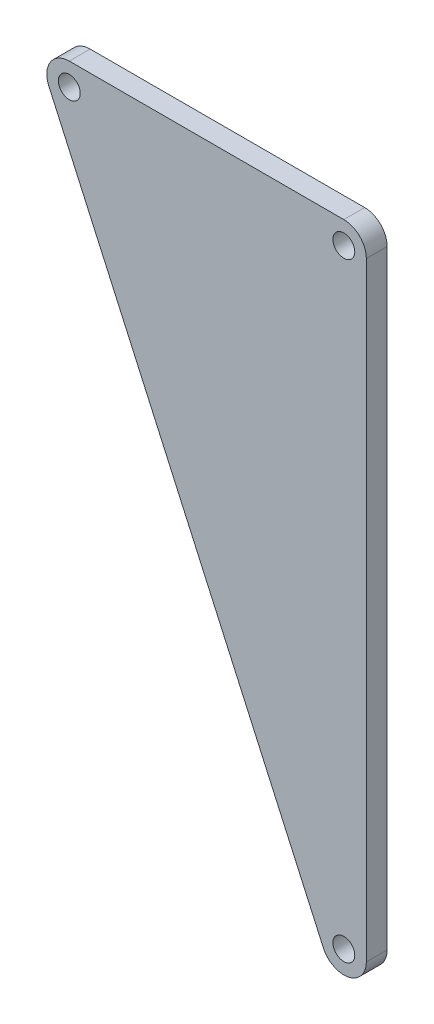
ISO-10303-21;
HEADER;
FILE_DESCRIPTION(('STEP AP214'),'2;1');
FILE_NAME('part.step','',(''),(''),'','','');
FILE_SCHEMA(('AUTOMOTIVE_DESIGN { 1 0 10303 214 1 1 1 1 }'));
ENDSEC;
DATA;
#1=APPLICATION_CONTEXT('core data for automotive mechanical design processes');
#2=APPLICATION_PROTOCOL_DEFINITION('international standard','automotive_design',2000,#1);
#3=PRODUCT_CONTEXT('',#1,'mechanical');
#4=PRODUCT('Part','Part','',(#3));
#5=PRODUCT_RELATED_PRODUCT_CATEGORY('part','',(#4));
#6=PRODUCT_DEFINITION_FORMATION('','',#4);
#7=PRODUCT_DEFINITION_CONTEXT('part definition',#1,'design');
#8=PRODUCT_DEFINITION('design','',#6,#7);
#9=PRODUCT_DEFINITION_SHAPE('','',#8);
#10=(LENGTH_UNIT() NAMED_UNIT(*) SI_UNIT(.MILLI.,.METRE.));
#11=(NAMED_UNIT(*) PLANE_ANGLE_UNIT() SI_UNIT($,.RADIAN.));
#12=(NAMED_UNIT(*) SI_UNIT($,.STERADIAN.) SOLID_ANGLE_UNIT());
#13=UNCERTAINTY_MEASURE_WITH_UNIT(LENGTH_MEASURE(1.E-05),#10,'distance_accuracy_value','');
#14=(GEOMETRIC_REPRESENTATION_CONTEXT(3) GLOBAL_UNCERTAINTY_ASSIGNED_CONTEXT((#13)) GLOBAL_UNIT_ASSIGNED_CONTEXT((#10,
#11,#12)) REPRESENTATION_CONTEXT('',''));
#15=CARTESIAN_POINT('',(0.,0.,0.));
#16=DIRECTION('',(0.,0.,1.));
#17=DIRECTION('',(1.,0.,0.));
#18=AXIS2_PLACEMENT_3D('',#15,#16,#17);
#19=CARTESIAN_POINT('',(0.,4.32,4.));
#20=DIRECTION('',(0.,1.,0.));
#21=DIRECTION('',(-1.,0.,0.));
#22=AXIS2_PLACEMENT_3D('',#19,#20,#21);
#23=PLANE('',#22);
#24=DIRECTION('',(1.,0.,0.));
#25=VECTOR('',#24,1.);
#26=CARTESIAN_POINT('',(0.,4.32,0.));
#27=LINE('',#26,#25);
#28=CARTESIAN_POINT('',(0.,4.32,0.));
#29=VERTEX_POINT('',#28);
#30=CARTESIAN_POINT('',(52.7,4.32,0.));
#31=VERTEX_POINT('',#30);
#32=EDGE_CURVE('E133',#29,#31,#27,.T.);
#33=ORIENTED_EDGE('',*,*,#32,.F.);
#34=DIRECTION('',(0.,0.,-1.));
#35=VECTOR('',#34,1.);
#36=CARTESIAN_POINT('',(0.,4.32,4.));
#37=LINE('',#36,#35);
#38=CARTESIAN_POINT('',(0.,4.32,4.));
#39=VERTEX_POINT('',#38);
#40=EDGE_CURVE('E11',#39,#29,#37,.T.);
#41=ORIENTED_EDGE('',*,*,#40,.F.);
#42=DIRECTION('',(1.,0.,0.));
#43=VECTOR('',#42,1.);
#44=CARTESIAN_POINT('',(0.,4.32,4.));
#45=LINE('',#44,#43);
#46=CARTESIAN_POINT('',(52.7,4.32,4.));
#47=VERTEX_POINT('',#46);
#48=EDGE_CURVE('E154',#39,#47,#45,.T.);
#49=ORIENTED_EDGE('',*,*,#48,.T.);
#50=DIRECTION('',(0.,0.,-1.));
#51=VECTOR('',#50,1.);
#52=CARTESIAN_POINT('',(52.7,4.32,4.));
#53=LINE('',#52,#51);
#54=EDGE_CURVE('E85',#47,#31,#53,.T.);
#55=ORIENTED_EDGE('',*,*,#54,.T.);
#56=EDGE_LOOP('',(#33,#41,#49,#55));
#57=FACE_BOUND('',#56,.T.);
#58=ADVANCED_FACE('F41',(#57),#23,.T.);
#59=CARTESIAN_POINT('',(0.,0.,4.));
#60=DIRECTION('',(0.,0.,-1.));
#61=DIRECTION('',(-1.,0.,0.));
#62=AXIS2_PLACEMENT_3D('',#59,#60,#61);
#63=CYLINDRICAL_SURFACE('',#62,4.32);
#64=CARTESIAN_POINT('',(0.,0.,0.));
#65=DIRECTION('',(0.,0.,1.));
#66=DIRECTION('',(1.,0.,0.));
#67=AXIS2_PLACEMENT_3D('',#64,#65,#66);
#68=CIRCLE('',#67,4.32);
#69=CARTESIAN_POINT('',(-3.93847296537443,-1.77505794300207,0.));
#70=VERTEX_POINT('',#69);
#71=EDGE_CURVE('E136',#29,#70,#68,.T.);
#72=ORIENTED_EDGE('',*,*,#71,.T.);
#73=DIRECTION('',(0.,0.,-1.));
#74=VECTOR('',#73,1.);
#75=CARTESIAN_POINT('',(-3.93847296537443,-1.77505794300207,4.));
#76=LINE('',#75,#74);
#77=CARTESIAN_POINT('',(-3.93847296537443,-1.77505794300207,4.));
#78=VERTEX_POINT('',#77);
#79=EDGE_CURVE('E49',#78,#70,#76,.T.);
#80=ORIENTED_EDGE('',*,*,#79,.F.);
#81=CARTESIAN_POINT('',(0.,0.,4.));
#82=DIRECTION('',(0.,0.,1.));
#83=DIRECTION('',(1.,0.,0.));
#84=AXIS2_PLACEMENT_3D('',#81,#82,#83);
#85=CIRCLE('',#84,4.32);
#86=EDGE_CURVE('E168',#39,#78,#85,.T.);
#87=ORIENTED_EDGE('',*,*,#86,.F.);
#88=ORIENTED_EDGE('',*,*,#40,.T.);
#89=EDGE_LOOP('',(#72,#80,#87,#88));
#90=FACE_BOUND('',#89,.T.);
#91=ADVANCED_FACE('F171',(#90),#63,.T.);
#92=CARTESIAN_POINT('',(-3.93847296537443,-1.77505794300207,4.));
#93=DIRECTION('',(0.911683556799636,0.410893042361591,0.));
#94=DIRECTION('',(-0.410893042361591,0.911683556799636,0.));
#95=AXIS2_PLACEMENT_3D('',#92,#93,#94);
#96=PLANE('',#95);
#97=DIRECTION('',(0.410893042361591,-0.911683556799636,0.));
#98=VECTOR('',#97,1.);
#99=CARTESIAN_POINT('',(-3.93847296537443,-1.77505794300207,0.));
#100=LINE('',#99,#98);
#101=CARTESIAN_POINT('',(48.7615270346256,-118.705057943002,0.));
#102=VERTEX_POINT('',#101);
#103=EDGE_CURVE('E138',#70,#102,#100,.T.);
#104=ORIENTED_EDGE('',*,*,#103,.T.);
#105=DIRECTION('',(0.,0.,-1.));
#106=VECTOR('',#105,1.);
#107=CARTESIAN_POINT('',(48.7615270346256,-118.705057943002,4.));
#108=LINE('',#107,#106);
#109=CARTESIAN_POINT('',(48.7615270346256,-118.705057943002,4.));
#110=VERTEX_POINT('',#109);
#111=EDGE_CURVE('E117',#110,#102,#108,.T.);
#112=ORIENTED_EDGE('',*,*,#111,.F.);
#113=DIRECTION('',(0.410893042361591,-0.911683556799636,0.));
#114=VECTOR('',#113,1.);
#115=CARTESIAN_POINT('',(-3.93847296537443,-1.77505794300207,4.));
#116=LINE('',#115,#114);
#117=EDGE_CURVE('E104',#78,#110,#116,.T.);
#118=ORIENTED_EDGE('',*,*,#117,.F.);
#119=ORIENTED_EDGE('',*,*,#79,.T.);
#120=EDGE_LOOP('',(#104,#112,#118,#119));
#121=FACE_BOUND('',#120,.T.);
#122=ADVANCED_FACE('F161',(#121),#96,.F.);
#123=CARTESIAN_POINT('',(52.7,-116.93,4.));
#124=DIRECTION('',(0.,0.,-1.));
#125=DIRECTION('',(-1.,0.,0.));
#126=AXIS2_PLACEMENT_3D('',#123,#124,#125);
#127=CYLINDRICAL_SURFACE('',#126,4.31999999999999);
#128=CARTESIAN_POINT('',(52.7,-116.93,0.));
#129=DIRECTION('',(0.,0.,1.));
#130=DIRECTION('',(1.,0.,0.));
#131=AXIS2_PLACEMENT_3D('',#128,#129,#130);
#132=CIRCLE('',#131,4.31999999999999);
#133=CARTESIAN_POINT('',(57.02,-116.93,0.));
#134=VERTEX_POINT('',#133);
#135=EDGE_CURVE('E113',#102,#134,#132,.T.);
#136=ORIENTED_EDGE('',*,*,#135,.T.);
#137=DIRECTION('',(0.,0.,-1.));
#138=VECTOR('',#137,1.);
#139=CARTESIAN_POINT('',(57.02,-116.93,4.));
#140=LINE('',#139,#138);
#141=CARTESIAN_POINT('',(57.02,-116.93,4.));
#142=VERTEX_POINT('',#141);
#143=EDGE_CURVE('E110',#142,#134,#140,.T.);
#144=ORIENTED_EDGE('',*,*,#143,.F.);
#145=CARTESIAN_POINT('',(52.7,-116.93,4.));
#146=DIRECTION('',(0.,0.,1.));
#147=DIRECTION('',(1.,0.,0.));
#148=AXIS2_PLACEMENT_3D('',#145,#146,#147);
#149=CIRCLE('',#148,4.31999999999999);
#150=EDGE_CURVE('E97',#110,#142,#149,.T.);
#151=ORIENTED_EDGE('',*,*,#150,.F.);
#152=ORIENTED_EDGE('',*,*,#111,.T.);
#153=EDGE_LOOP('',(#136,#144,#151,#152));
#154=FACE_BOUND('',#153,.T.);
#155=ADVANCED_FACE('F111',(#154),#127,.T.);
#156=CARTESIAN_POINT('',(57.02,0.,4.));
#157=DIRECTION('',(1.,0.,0.));
#158=DIRECTION('',(0.,0.,-1.));
#159=AXIS2_PLACEMENT_3D('',#156,#157,#158);
#160=PLANE('',#159);
#161=DIRECTION('',(0.,-1.,0.));
#162=VECTOR('',#161,1.);
#163=CARTESIAN_POINT('',(57.02,0.,0.));
#164=LINE('',#163,#162);
#165=CARTESIAN_POINT('',(57.02,0.,0.));
#166=VERTEX_POINT('',#165);
#167=EDGE_CURVE('E141',#166,#134,#164,.T.);
#168=ORIENTED_EDGE('',*,*,#167,.F.);
#169=DIRECTION('',(0.,0.,-1.));
#170=VECTOR('',#169,1.);
#171=CARTESIAN_POINT('',(57.02,0.,4.));
#172=LINE('',#171,#170);
#173=CARTESIAN_POINT('',(57.02,0.,4.));
#174=VERTEX_POINT('',#173);
#175=EDGE_CURVE('E78',#174,#166,#172,.T.);
#176=ORIENTED_EDGE('',*,*,#175,.F.);
#177=DIRECTION('',(0.,-1.,0.));
#178=VECTOR('',#177,1.);
#179=CARTESIAN_POINT('',(57.02,0.,4.));
#180=LINE('',#179,#178);
#181=EDGE_CURVE('E102',#174,#142,#180,.T.);
#182=ORIENTED_EDGE('',*,*,#181,.T.);
#183=ORIENTED_EDGE('',*,*,#143,.T.);
#184=EDGE_LOOP('',(#168,#176,#182,#183));
#185=FACE_BOUND('',#184,.T.);
#186=ADVANCED_FACE('F119',(#185),#160,.T.);
#187=CARTESIAN_POINT('',(52.7,-116.93,4.));
#188=DIRECTION('',(0.,0.,-1.));
#189=DIRECTION('',(-1.,0.,0.));
#190=AXIS2_PLACEMENT_3D('',#187,#188,#189);
#191=CYLINDRICAL_SURFACE('',#190,2.1);
#192=CARTESIAN_POINT('',(52.7,-116.93,4.));
#193=DIRECTION('',(0.,0.,1.));
#194=DIRECTION('',(1.,0.,0.));
#195=AXIS2_PLACEMENT_3D('',#192,#193,#194);
#196=CIRCLE('',#195,2.1);
#197=CARTESIAN_POINT('',(54.8,-116.93,4.));
#198=VERTEX_POINT('',#197);
#199=EDGE_CURVE('E127',#198,#198,#196,.T.);
#200=ORIENTED_EDGE('',*,*,#199,.T.);
#201=EDGE_LOOP('',(#200));
#202=FACE_BOUND('',#201,.T.);
#203=CARTESIAN_POINT('',(52.7,-116.93,0.));
#204=DIRECTION('',(0.,0.,1.));
#205=DIRECTION('',(1.,0.,0.));
#206=AXIS2_PLACEMENT_3D('',#203,#204,#205);
#207=CIRCLE('',#206,2.1);
#208=CARTESIAN_POINT('',(54.8,-116.93,0.));
#209=VERTEX_POINT('',#208);
#210=EDGE_CURVE('E148',#209,#209,#207,.T.);
#211=ORIENTED_EDGE('',*,*,#210,.F.);
#212=EDGE_LOOP('',(#211));
#213=FACE_BOUND('',#212,.T.);
#214=ADVANCED_FACE('F183',(#202,#213),#191,.F.);
#215=CARTESIAN_POINT('',(52.7,0.,4.));
#216=DIRECTION('',(0.,0.,-1.));
#217=DIRECTION('',(-1.,0.,0.));
#218=AXIS2_PLACEMENT_3D('',#215,#216,#217);
#219=CYLINDRICAL_SURFACE('',#218,2.1);
#220=CARTESIAN_POINT('',(52.7,0.,4.));
#221=DIRECTION('',(0.,0.,1.));
#222=DIRECTION('',(1.,0.,0.));
#223=AXIS2_PLACEMENT_3D('',#220,#221,#222);
#224=CIRCLE('',#223,2.1);
#225=CARTESIAN_POINT('',(54.8,0.,4.));
#226=VERTEX_POINT('',#225);
#227=EDGE_CURVE('E121',#226,#226,#224,.T.);
#228=ORIENTED_EDGE('',*,*,#227,.T.);
#229=EDGE_LOOP('',(#228));
#230=FACE_BOUND('',#229,.T.);
#231=CARTESIAN_POINT('',(52.7,0.,0.));
#232=DIRECTION('',(0.,0.,1.));
#233=DIRECTION('',(1.,0.,0.));
#234=AXIS2_PLACEMENT_3D('',#231,#232,#233);
#235=CIRCLE('',#234,2.1);
#236=CARTESIAN_POINT('',(54.8,0.,0.));
#237=VERTEX_POINT('',#236);
#238=EDGE_CURVE('E145',#237,#237,#235,.T.);
#239=ORIENTED_EDGE('',*,*,#238,.F.);
#240=EDGE_LOOP('',(#239));
#241=FACE_BOUND('',#240,.T.);
#242=ADVANCED_FACE('F187',(#230,#241),#219,.F.);
#243=CARTESIAN_POINT('',(52.7,0.,4.));
#244=DIRECTION('',(0.,0.,-1.));
#245=DIRECTION('',(-1.,0.,0.));
#246=AXIS2_PLACEMENT_3D('',#243,#244,#245);
#247=CYLINDRICAL_SURFACE('',#246,4.32);
#248=CARTESIAN_POINT('',(52.7,0.,0.));
#249=DIRECTION('',(0.,0.,1.));
#250=DIRECTION('',(1.,0.,0.));
#251=AXIS2_PLACEMENT_3D('',#248,#249,#250);
#252=CIRCLE('',#251,4.32);
#253=EDGE_CURVE('E143',#166,#31,#252,.T.);
#254=ORIENTED_EDGE('',*,*,#253,.T.);
#255=ORIENTED_EDGE('',*,*,#54,.F.);
#256=CARTESIAN_POINT('',(52.7,0.,4.));
#257=DIRECTION('',(0.,0.,1.));
#258=DIRECTION('',(1.,0.,0.));
#259=AXIS2_PLACEMENT_3D('',#256,#257,#258);
#260=CIRCLE('',#259,4.32);
#261=EDGE_CURVE('E57',#174,#47,#260,.T.);
#262=ORIENTED_EDGE('',*,*,#261,.F.);
#263=ORIENTED_EDGE('',*,*,#175,.T.);
#264=EDGE_LOOP('',(#254,#255,#262,#263));
#265=FACE_BOUND('',#264,.T.);
#266=ADVANCED_FACE('F167',(#265),#247,.T.);
#267=CARTESIAN_POINT('',(0.,0.,4.));
#268=DIRECTION('',(0.,0.,-1.));
#269=DIRECTION('',(-1.,0.,0.));
#270=AXIS2_PLACEMENT_3D('',#267,#268,#269);
#271=CYLINDRICAL_SURFACE('',#270,2.1);
#272=CARTESIAN_POINT('',(0.,0.,4.));
#273=DIRECTION('',(0.,0.,1.));
#274=DIRECTION('',(1.,0.,0.));
#275=AXIS2_PLACEMENT_3D('',#272,#273,#274);
#276=CIRCLE('',#275,2.1);
#277=CARTESIAN_POINT('',(2.1,0.,4.));
#278=VERTEX_POINT('',#277);
#279=EDGE_CURVE('E130',#278,#278,#276,.T.);
#280=ORIENTED_EDGE('',*,*,#279,.T.);
#281=EDGE_LOOP('',(#280));
#282=FACE_BOUND('',#281,.T.);
#283=CARTESIAN_POINT('',(0.,0.,0.));
#284=DIRECTION('',(0.,0.,1.));
#285=DIRECTION('',(1.,0.,0.));
#286=AXIS2_PLACEMENT_3D('',#283,#284,#285);
#287=CIRCLE('',#286,2.1);
#288=CARTESIAN_POINT('',(2.1,0.,0.));
#289=VERTEX_POINT('',#288);
#290=EDGE_CURVE('E151',#289,#289,#287,.T.);
#291=ORIENTED_EDGE('',*,*,#290,.F.);
#292=EDGE_LOOP('',(#291));
#293=FACE_BOUND('',#292,.T.);
#294=ADVANCED_FACE('F186',(#282,#293),#271,.F.);
#295=CARTESIAN_POINT('',(0.,0.,4.));
#296=DIRECTION('',(0.,0.,1.));
#297=DIRECTION('',(1.,0.,0.));
#298=AXIS2_PLACEMENT_3D('',#295,#296,#297);
#299=PLANE('',#298);
#300=ORIENTED_EDGE('',*,*,#48,.F.);
#301=ORIENTED_EDGE('',*,*,#86,.T.);
#302=ORIENTED_EDGE('',*,*,#117,.T.);
#303=ORIENTED_EDGE('',*,*,#150,.T.);
#304=ORIENTED_EDGE('',*,*,#181,.F.);
#305=ORIENTED_EDGE('',*,*,#261,.T.);
#306=EDGE_LOOP('',(#300,#301,#302,#303,#304,#305));
#307=FACE_BOUND('',#306,.T.);
#308=ORIENTED_EDGE('',*,*,#227,.F.);
#309=EDGE_LOOP('',(#308));
#310=FACE_BOUND('',#309,.T.);
#311=ORIENTED_EDGE('',*,*,#199,.F.);
#312=EDGE_LOOP('',(#311));
#313=FACE_BOUND('',#312,.T.);
#314=ORIENTED_EDGE('',*,*,#279,.F.);
#315=EDGE_LOOP('',(#314));
#316=FACE_BOUND('',#315,.T.);
#317=ADVANCED_FACE('F99',(#307,#310,#313,#316),#299,.T.);
#318=CARTESIAN_POINT('',(0.,0.,0.));
#319=DIRECTION('',(0.,0.,1.));
#320=DIRECTION('',(1.,0.,0.));
#321=AXIS2_PLACEMENT_3D('',#318,#319,#320);
#322=PLANE('',#321);
#323=ORIENTED_EDGE('',*,*,#32,.T.);
#324=ORIENTED_EDGE('',*,*,#253,.F.);
#325=ORIENTED_EDGE('',*,*,#167,.T.);
#326=ORIENTED_EDGE('',*,*,#135,.F.);
#327=ORIENTED_EDGE('',*,*,#103,.F.);
#328=ORIENTED_EDGE('',*,*,#71,.F.);
#329=EDGE_LOOP('',(#323,#324,#325,#326,#327,#328));
#330=FACE_BOUND('',#329,.T.);
#331=ORIENTED_EDGE('',*,*,#238,.T.);
#332=EDGE_LOOP('',(#331));
#333=FACE_BOUND('',#332,.T.);
#334=ORIENTED_EDGE('',*,*,#210,.T.);
#335=EDGE_LOOP('',(#334));
#336=FACE_BOUND('',#335,.T.);
#337=ORIENTED_EDGE('',*,*,#290,.T.);
#338=EDGE_LOOP('',(#337));
#339=FACE_BOUND('',#338,.T.);
#340=ADVANCED_FACE('F165',(#330,#333,#336,#339),#322,.F.);
#341=CLOSED_SHELL('',(#58,#91,#122,#155,#186,#214,#242,#266,#294,#317,#340));
#342=MANIFOLD_SOLID_BREP('B2',#341);
#343=ADVANCED_BREP_SHAPE_REPRESENTATION('',(#18,#342),#14);
#344=SHAPE_DEFINITION_REPRESENTATION(#9,#343);
ENDSEC;
END-ISO-10303-21;
